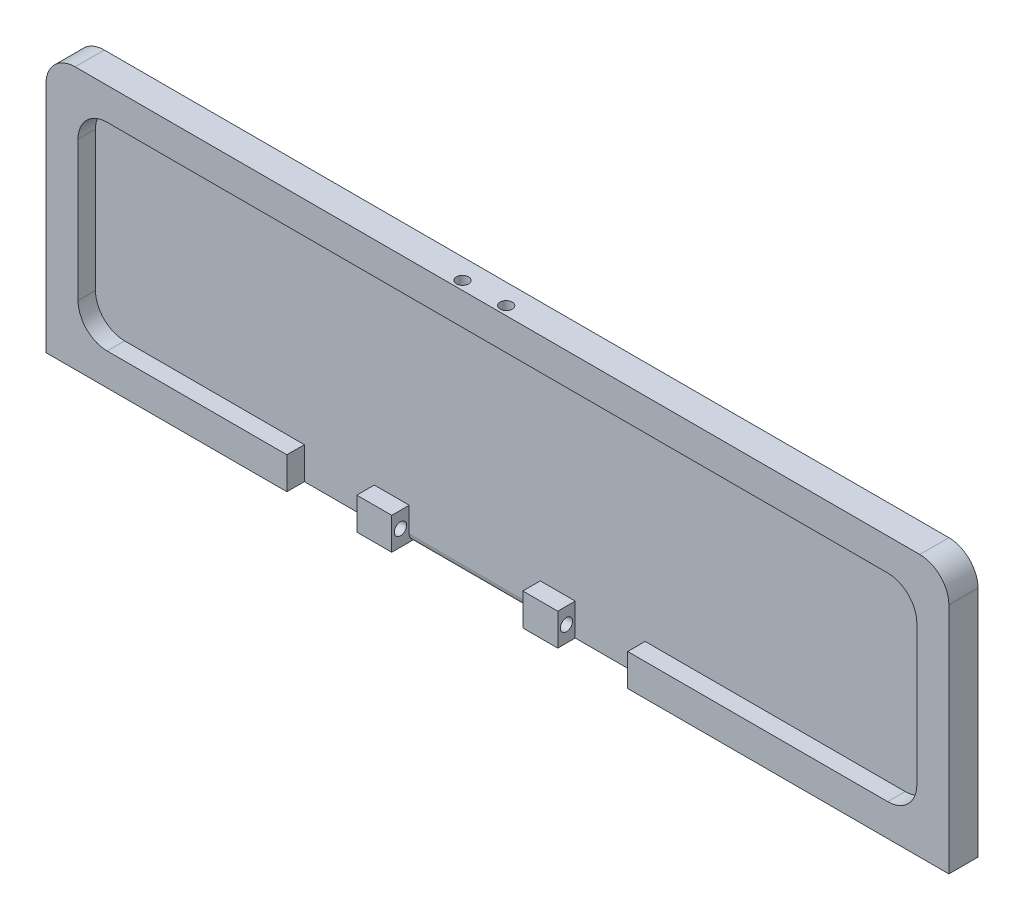
ISO-10303-21;
HEADER;
FILE_DESCRIPTION(('STEP AP214'),'2;1');
FILE_NAME('part.step','',(''),(''),'','','');
FILE_SCHEMA(('AUTOMOTIVE_DESIGN { 1 0 10303 214 1 1 1 1 }'));
ENDSEC;
DATA;
#1=APPLICATION_CONTEXT('core data for automotive mechanical design processes');
#2=APPLICATION_PROTOCOL_DEFINITION('international standard','automotive_design',2000,#1);
#3=PRODUCT_CONTEXT('',#1,'mechanical');
#4=PRODUCT('Part','Part','',(#3));
#5=PRODUCT_RELATED_PRODUCT_CATEGORY('part','',(#4));
#6=PRODUCT_DEFINITION_FORMATION('','',#4);
#7=PRODUCT_DEFINITION_CONTEXT('part definition',#1,'design');
#8=PRODUCT_DEFINITION('design','',#6,#7);
#9=PRODUCT_DEFINITION_SHAPE('','',#8);
#10=(LENGTH_UNIT() NAMED_UNIT(*) SI_UNIT(.MILLI.,.METRE.));
#11=(NAMED_UNIT(*) PLANE_ANGLE_UNIT() SI_UNIT($,.RADIAN.));
#12=(NAMED_UNIT(*) SI_UNIT($,.STERADIAN.) SOLID_ANGLE_UNIT());
#13=UNCERTAINTY_MEASURE_WITH_UNIT(LENGTH_MEASURE(1.E-05),#10,'distance_accuracy_value','');
#14=(GEOMETRIC_REPRESENTATION_CONTEXT(3) GLOBAL_UNCERTAINTY_ASSIGNED_CONTEXT((#13)) GLOBAL_UNIT_ASSIGNED_CONTEXT((#10,
#11,#12)) REPRESENTATION_CONTEXT('',''));
#15=CARTESIAN_POINT('',(0.,0.,0.));
#16=DIRECTION('',(0.,0.,1.));
#17=DIRECTION('',(1.,0.,0.));
#18=AXIS2_PLACEMENT_3D('',#15,#16,#17);
#19=CARTESIAN_POINT('',(0.,0.,5.));
#20=DIRECTION('',(0.,0.,1.));
#21=DIRECTION('',(1.,0.,0.));
#22=AXIS2_PLACEMENT_3D('',#19,#20,#21);
#23=PLANE('',#22);
#24=DIRECTION('',(0.,-1.,0.));
#25=VECTOR('',#24,1.);
#26=CARTESIAN_POINT('',(-36.1457275828644,-17.,5.));
#27=LINE('',#26,#25);
#28=CARTESIAN_POINT('',(-36.1457275828644,-17.,5.));
#29=VERTEX_POINT('',#28);
#30=CARTESIAN_POINT('',(-36.1457275828644,-22.5,5.));
#31=VERTEX_POINT('',#30);
#32=EDGE_CURVE('E232',#29,#31,#27,.T.);
#33=ORIENTED_EDGE('',*,*,#32,.F.);
#34=DIRECTION('',(1.,0.,0.));
#35=VECTOR('',#34,1.);
#36=CARTESIAN_POINT('',(72.,-17.,5.));
#37=LINE('',#36,#35);
#38=CARTESIAN_POINT('',(-67.,-17.,5.));
#39=VERTEX_POINT('',#38);
#40=EDGE_CURVE('E288',#39,#29,#37,.T.);
#41=ORIENTED_EDGE('',*,*,#40,.F.);
#42=CARTESIAN_POINT('',(-67.,-12.,5.));
#43=DIRECTION('',(0.,0.,1.));
#44=DIRECTION('',(1.,0.,0.));
#45=AXIS2_PLACEMENT_3D('',#42,#43,#44);
#46=CIRCLE('',#45,5.);
#47=CARTESIAN_POINT('',(-72.,-12.,5.));
#48=VERTEX_POINT('',#47);
#49=EDGE_CURVE('E463',#39,#48,#46,.F.);
#50=ORIENTED_EDGE('',*,*,#49,.T.);
#51=DIRECTION('',(0.,-1.,0.));
#52=VECTOR('',#51,1.);
#53=CARTESIAN_POINT('',(-72.,-17.,5.));
#54=LINE('',#53,#52);
#55=CARTESIAN_POINT('',(-72.,12.,5.));
#56=VERTEX_POINT('',#55);
#57=EDGE_CURVE('E293',#56,#48,#54,.T.);
#58=ORIENTED_EDGE('',*,*,#57,.F.);
#59=CARTESIAN_POINT('',(-67.,12.,5.));
#60=DIRECTION('',(0.,0.,1.));
#61=DIRECTION('',(1.,0.,0.));
#62=AXIS2_PLACEMENT_3D('',#59,#60,#61);
#63=CIRCLE('',#62,5.);
#64=CARTESIAN_POINT('',(-67.,17.,5.));
#65=VERTEX_POINT('',#64);
#66=EDGE_CURVE('E460',#56,#65,#63,.F.);
#67=ORIENTED_EDGE('',*,*,#66,.T.);
#68=DIRECTION('',(-1.,0.,0.));
#69=VECTOR('',#68,1.);
#70=CARTESIAN_POINT('',(72.,17.,5.));
#71=LINE('',#70,#69);
#72=CARTESIAN_POINT('',(67.,17.,5.));
#73=VERTEX_POINT('',#72);
#74=EDGE_CURVE('E280',#73,#65,#71,.T.);
#75=ORIENTED_EDGE('',*,*,#74,.F.);
#76=CARTESIAN_POINT('',(67.,12.,5.));
#77=DIRECTION('',(0.,0.,1.));
#78=DIRECTION('',(1.,0.,0.));
#79=AXIS2_PLACEMENT_3D('',#76,#77,#78);
#80=CIRCLE('',#79,5.);
#81=CARTESIAN_POINT('',(72.,12.,5.));
#82=VERTEX_POINT('',#81);
#83=EDGE_CURVE('E469',#73,#82,#80,.F.);
#84=ORIENTED_EDGE('',*,*,#83,.T.);
#85=DIRECTION('',(0.,1.,0.));
#86=VECTOR('',#85,1.);
#87=CARTESIAN_POINT('',(72.,-17.,5.));
#88=LINE('',#87,#86);
#89=CARTESIAN_POINT('',(72.,-12.,5.));
#90=VERTEX_POINT('',#89);
#91=EDGE_CURVE('E285',#90,#82,#88,.T.);
#92=ORIENTED_EDGE('',*,*,#91,.F.);
#93=CARTESIAN_POINT('',(67.,-12.,5.));
#94=DIRECTION('',(0.,0.,1.));
#95=DIRECTION('',(1.,0.,0.));
#96=AXIS2_PLACEMENT_3D('',#93,#94,#95);
#97=CIRCLE('',#96,5.);
#98=CARTESIAN_POINT('',(67.,-17.,5.));
#99=VERTEX_POINT('',#98);
#100=EDGE_CURVE('E466',#90,#99,#97,.F.);
#101=ORIENTED_EDGE('',*,*,#100,.T.);
#102=CARTESIAN_POINT('',(22.3542724171356,-17.,5.));
#103=VERTEX_POINT('',#102);
#104=EDGE_CURVE('E297',#103,#99,#37,.T.);
#105=ORIENTED_EDGE('',*,*,#104,.F.);
#106=DIRECTION('',(0.,1.,0.));
#107=VECTOR('',#106,1.);
#108=CARTESIAN_POINT('',(22.3542724171356,-17.,5.));
#109=LINE('',#108,#107);
#110=CARTESIAN_POINT('',(22.3542724171356,-22.5,5.));
#111=VERTEX_POINT('',#110);
#112=EDGE_CURVE('E362',#111,#103,#109,.T.);
#113=ORIENTED_EDGE('',*,*,#112,.F.);
#114=DIRECTION('',(1.,0.,0.));
#115=VECTOR('',#114,1.);
#116=CARTESIAN_POINT('',(77.5,-22.5,5.));
#117=LINE('',#116,#115);
#118=CARTESIAN_POINT('',(77.5,-22.5,5.));
#119=VERTEX_POINT('',#118);
#120=EDGE_CURVE('E251',#111,#119,#117,.T.);
#121=ORIENTED_EDGE('',*,*,#120,.T.);
#122=DIRECTION('',(0.,1.,0.));
#123=VECTOR('',#122,1.);
#124=CARTESIAN_POINT('',(77.5,-22.5,5.));
#125=LINE('',#124,#123);
#126=CARTESIAN_POINT('',(77.5,17.5,5.));
#127=VERTEX_POINT('',#126);
#128=EDGE_CURVE('E256',#119,#127,#125,.T.);
#129=ORIENTED_EDGE('',*,*,#128,.T.);
#130=CARTESIAN_POINT('',(72.5,17.5,5.));
#131=DIRECTION('',(0.,0.,1.));
#132=DIRECTION('',(1.,0.,0.));
#133=AXIS2_PLACEMENT_3D('',#130,#131,#132);
#134=CIRCLE('',#133,5.);
#135=CARTESIAN_POINT('',(72.5,22.5,5.));
#136=VERTEX_POINT('',#135);
#137=EDGE_CURVE('E557',#127,#136,#134,.T.);
#138=ORIENTED_EDGE('',*,*,#137,.T.);
#139=DIRECTION('',(-1.,0.,0.));
#140=VECTOR('',#139,1.);
#141=CARTESIAN_POINT('',(77.5,22.5,5.));
#142=LINE('',#141,#140);
#143=CARTESIAN_POINT('',(-72.5,22.5,5.));
#144=VERTEX_POINT('',#143);
#145=EDGE_CURVE('E587',#136,#144,#142,.T.);
#146=ORIENTED_EDGE('',*,*,#145,.T.);
#147=CARTESIAN_POINT('',(-72.5,17.5,5.));
#148=DIRECTION('',(0.,0.,1.));
#149=DIRECTION('',(1.,0.,0.));
#150=AXIS2_PLACEMENT_3D('',#147,#148,#149);
#151=CIRCLE('',#150,5.);
#152=CARTESIAN_POINT('',(-77.5,17.5,5.));
#153=VERTEX_POINT('',#152);
#154=EDGE_CURVE('E562',#144,#153,#151,.T.);
#155=ORIENTED_EDGE('',*,*,#154,.T.);
#156=DIRECTION('',(0.,-1.,0.));
#157=VECTOR('',#156,1.);
#158=CARTESIAN_POINT('',(-77.5,-22.5,5.));
#159=LINE('',#158,#157);
#160=CARTESIAN_POINT('',(-77.5,-22.5,5.));
#161=VERTEX_POINT('',#160);
#162=EDGE_CURVE('E262',#153,#161,#159,.T.);
#163=ORIENTED_EDGE('',*,*,#162,.T.);
#164=EDGE_CURVE('E248',#161,#31,#117,.T.);
#165=ORIENTED_EDGE('',*,*,#164,.T.);
#166=EDGE_LOOP('',(#33,#41,#50,#58,#67,#75,#84,#92,#101,#105,#113,#121,#129,#138,#146,#155,#163,#165));
#167=FACE_BOUND('',#166,.T.);
#168=ADVANCED_FACE('F43',(#167),#23,.T.);
#169=CARTESIAN_POINT('',(72.,-17.,2.));
#170=DIRECTION('',(0.,-1.,0.));
#171=DIRECTION('',(0.,0.,-1.));
#172=AXIS2_PLACEMENT_3D('',#169,#170,#171);
#173=PLANE('',#172);
#174=ORIENTED_EDGE('',*,*,#40,.T.);
#175=DIRECTION('',(0.,0.,1.));
#176=VECTOR('',#175,1.);
#177=CARTESIAN_POINT('',(-36.1457275828644,-17.,-11.2003787824441));
#178=LINE('',#177,#176);
#179=CARTESIAN_POINT('',(-36.1457275828644,-17.,2.));
#180=VERTEX_POINT('',#179);
#181=EDGE_CURVE('E405',#180,#29,#178,.T.);
#182=ORIENTED_EDGE('',*,*,#181,.F.);
#183=DIRECTION('',(1.,0.,0.));
#184=VECTOR('',#183,1.);
#185=CARTESIAN_POINT('',(72.,-17.,2.));
#186=LINE('',#185,#184);
#187=CARTESIAN_POINT('',(-67.,-17.,2.));
#188=VERTEX_POINT('',#187);
#189=EDGE_CURVE('E308',#188,#180,#186,.T.);
#190=ORIENTED_EDGE('',*,*,#189,.F.);
#191=DIRECTION('',(0.,0.,1.));
#192=VECTOR('',#191,1.);
#193=CARTESIAN_POINT('',(-67.,-17.,5.));
#194=LINE('',#193,#192);
#195=EDGE_CURVE('E450',#188,#39,#194,.T.);
#196=ORIENTED_EDGE('',*,*,#195,.T.);
#197=EDGE_LOOP('',(#174,#182,#190,#196));
#198=FACE_BOUND('',#197,.T.);
#199=ADVANCED_FACE('F426',(#198),#173,.F.);
#200=CARTESIAN_POINT('',(4.35427241713557,-17.,5.));
#201=VERTEX_POINT('',#200);
#202=CARTESIAN_POINT('',(10.3542724171356,-17.,5.));
#203=VERTEX_POINT('',#202);
#204=EDGE_CURVE('E292',#201,#203,#37,.T.);
#205=ORIENTED_EDGE('',*,*,#204,.T.);
#206=DIRECTION('',(0.,0.,1.));
#207=VECTOR('',#206,1.);
#208=CARTESIAN_POINT('',(10.3542724171356,-17.,2.));
#209=LINE('',#208,#207);
#210=CARTESIAN_POINT('',(10.3542724171356,-17.,2.));
#211=VERTEX_POINT('',#210);
#212=EDGE_CURVE('E352',#211,#203,#209,.T.);
#213=ORIENTED_EDGE('',*,*,#212,.F.);
#214=CARTESIAN_POINT('',(4.35427241713557,-17.,2.));
#215=VERTEX_POINT('',#214);
#216=EDGE_CURVE('E313',#215,#211,#186,.T.);
#217=ORIENTED_EDGE('',*,*,#216,.F.);
#218=DIRECTION('',(0.,0.,1.));
#219=VECTOR('',#218,1.);
#220=CARTESIAN_POINT('',(4.35427241713557,-17.,2.));
#221=LINE('',#220,#219);
#222=EDGE_CURVE('E298',#215,#201,#221,.T.);
#223=ORIENTED_EDGE('',*,*,#222,.T.);
#224=EDGE_LOOP('',(#205,#213,#217,#223));
#225=FACE_BOUND('',#224,.T.);
#226=ADVANCED_FACE('F499',(#225),#173,.F.);
#227=DIRECTION('',(0.,-1.,0.));
#228=VECTOR('',#227,1.);
#229=CARTESIAN_POINT('',(10.3542724171356,-22.5,5.));
#230=LINE('',#229,#228);
#231=CARTESIAN_POINT('',(10.3542724171356,-22.5,5.));
#232=VERTEX_POINT('',#231);
#233=EDGE_CURVE('E358',#203,#232,#230,.T.);
#234=ORIENTED_EDGE('',*,*,#233,.F.);
#235=ORIENTED_EDGE('',*,*,#204,.F.);
#236=DIRECTION('',(0.,1.,0.));
#237=VECTOR('',#236,1.);
#238=CARTESIAN_POINT('',(4.35427241713557,-17.,5.));
#239=LINE('',#238,#237);
#240=CARTESIAN_POINT('',(4.35427241713557,-22.5,5.));
#241=VERTEX_POINT('',#240);
#242=EDGE_CURVE('E331',#241,#201,#239,.T.);
#243=ORIENTED_EDGE('',*,*,#242,.F.);
#244=EDGE_CURVE('E249',#241,#232,#117,.T.);
#245=ORIENTED_EDGE('',*,*,#244,.T.);
#246=EDGE_LOOP('',(#234,#235,#243,#245));
#247=FACE_BOUND('',#246,.T.);
#248=ADVANCED_FACE('F494',(#247),#23,.T.);
#249=CARTESIAN_POINT('',(22.3542724171356,-17.,2.));
#250=VERTEX_POINT('',#249);
#251=CARTESIAN_POINT('',(67.,-17.,2.));
#252=VERTEX_POINT('',#251);
#253=EDGE_CURVE('E317',#250,#252,#186,.T.);
#254=ORIENTED_EDGE('',*,*,#253,.F.);
#255=DIRECTION('',(0.,0.,1.));
#256=VECTOR('',#255,1.);
#257=CARTESIAN_POINT('',(22.3542724171356,-17.,2.));
#258=LINE('',#257,#256);
#259=EDGE_CURVE('E347',#250,#103,#258,.T.);
#260=ORIENTED_EDGE('',*,*,#259,.T.);
#261=ORIENTED_EDGE('',*,*,#104,.T.);
#262=DIRECTION('',(0.,0.,1.));
#263=VECTOR('',#262,1.);
#264=CARTESIAN_POINT('',(67.,-17.,2.));
#265=LINE('',#264,#263);
#266=EDGE_CURVE('E441',#99,#252,#265,.F.);
#267=ORIENTED_EDGE('',*,*,#266,.T.);
#268=EDGE_LOOP('',(#254,#260,#261,#267));
#269=FACE_BOUND('',#268,.T.);
#270=ADVANCED_FACE('F512',(#269),#173,.F.);
#271=CARTESIAN_POINT('',(-77.5,-22.5,5.));
#272=DIRECTION('',(1.,0.,0.));
#273=DIRECTION('',(0.,0.,-1.));
#274=AXIS2_PLACEMENT_3D('',#271,#272,#273);
#275=PLANE('',#274);
#276=ORIENTED_EDGE('',*,*,#162,.F.);
#277=DIRECTION('',(0.,0.,-1.));
#278=VECTOR('',#277,1.);
#279=CARTESIAN_POINT('',(-77.5,17.5,5.));
#280=LINE('',#279,#278);
#281=CARTESIAN_POINT('',(-77.5,17.5,0.));
#282=VERTEX_POINT('',#281);
#283=EDGE_CURVE('E554',#153,#282,#280,.T.);
#284=ORIENTED_EDGE('',*,*,#283,.T.);
#285=DIRECTION('',(0.,-1.,0.));
#286=VECTOR('',#285,1.);
#287=CARTESIAN_POINT('',(-77.5,-22.5,0.));
#288=LINE('',#287,#286);
#289=CARTESIAN_POINT('',(-77.5,-22.5,0.));
#290=VERTEX_POINT('',#289);
#291=EDGE_CURVE('E303',#282,#290,#288,.T.);
#292=ORIENTED_EDGE('',*,*,#291,.T.);
#293=DIRECTION('',(0.,0.,-1.));
#294=VECTOR('',#293,1.);
#295=CARTESIAN_POINT('',(-77.5,-22.5,5.));
#296=LINE('',#295,#294);
#297=EDGE_CURVE('E581',#161,#290,#296,.T.);
#298=ORIENTED_EDGE('',*,*,#297,.F.);
#299=EDGE_LOOP('',(#276,#284,#292,#298));
#300=FACE_BOUND('',#299,.T.);
#301=ADVANCED_FACE('F620',(#300),#275,.F.);
#302=CARTESIAN_POINT('',(77.5,-22.5,5.));
#303=DIRECTION('',(0.,1.,0.));
#304=DIRECTION('',(-1.,0.,0.));
#305=AXIS2_PLACEMENT_3D('',#302,#303,#304);
#306=PLANE('',#305);
#307=DIRECTION('',(-1.,0.,0.));
#308=VECTOR('',#307,1.);
#309=CARTESIAN_POINT('',(-36.1457275828644,-22.5,2.));
#310=LINE('',#309,#308);
#311=CARTESIAN_POINT('',(-24.1457275828644,-22.5,2.));
#312=VERTEX_POINT('',#311);
#313=CARTESIAN_POINT('',(-36.1457275828644,-22.5,2.));
#314=VERTEX_POINT('',#313);
#315=EDGE_CURVE('E401',#312,#314,#310,.T.);
#316=ORIENTED_EDGE('',*,*,#315,.T.);
#317=DIRECTION('',(0.,0.,1.));
#318=VECTOR('',#317,1.);
#319=CARTESIAN_POINT('',(-36.1457275828644,-22.5,-11.2003787824441));
#320=LINE('',#319,#318);
#321=EDGE_CURVE('E407',#314,#31,#320,.T.);
#322=ORIENTED_EDGE('',*,*,#321,.T.);
#323=ORIENTED_EDGE('',*,*,#164,.F.);
#324=ORIENTED_EDGE('',*,*,#297,.T.);
#325=DIRECTION('',(1.,0.,0.));
#326=VECTOR('',#325,1.);
#327=CARTESIAN_POINT('',(77.5,-22.5,0.));
#328=LINE('',#327,#326);
#329=CARTESIAN_POINT('',(77.5,-22.5,0.));
#330=VERTEX_POINT('',#329);
#331=EDGE_CURVE('E592',#290,#330,#328,.T.);
#332=ORIENTED_EDGE('',*,*,#331,.T.);
#333=DIRECTION('',(0.,0.,-1.));
#334=VECTOR('',#333,1.);
#335=CARTESIAN_POINT('',(77.5,-22.5,5.));
#336=LINE('',#335,#334);
#337=EDGE_CURVE('E585',#119,#330,#336,.T.);
#338=ORIENTED_EDGE('',*,*,#337,.F.);
#339=ORIENTED_EDGE('',*,*,#120,.F.);
#340=DIRECTION('',(0.,0.,1.));
#341=VECTOR('',#340,1.);
#342=CARTESIAN_POINT('',(22.3542724171356,-22.5,2.));
#343=LINE('',#342,#341);
#344=CARTESIAN_POINT('',(22.3542724171356,-22.5,2.));
#345=VERTEX_POINT('',#344);
#346=EDGE_CURVE('E344',#345,#111,#343,.T.);
#347=ORIENTED_EDGE('',*,*,#346,.F.);
#348=DIRECTION('',(1.,0.,0.));
#349=VECTOR('',#348,1.);
#350=CARTESIAN_POINT('',(22.3542724171356,-22.5,2.));
#351=LINE('',#350,#349);
#352=CARTESIAN_POINT('',(10.3542724171356,-22.5,2.));
#353=VERTEX_POINT('',#352);
#354=EDGE_CURVE('E361',#353,#345,#351,.T.);
#355=ORIENTED_EDGE('',*,*,#354,.F.);
#356=DIRECTION('',(0.,0.,1.));
#357=VECTOR('',#356,1.);
#358=CARTESIAN_POINT('',(10.3542724171356,-22.5,2.));
#359=LINE('',#358,#357);
#360=EDGE_CURVE('E338',#353,#232,#359,.T.);
#361=ORIENTED_EDGE('',*,*,#360,.T.);
#362=ORIENTED_EDGE('',*,*,#244,.F.);
#363=DIRECTION('',(0.,0.,1.));
#364=VECTOR('',#363,1.);
#365=CARTESIAN_POINT('',(4.35427241713557,-22.5,2.));
#366=LINE('',#365,#364);
#367=CARTESIAN_POINT('',(4.35427241713557,-22.5,0.8));
#368=VERTEX_POINT('',#367);
#369=EDGE_CURVE('E325',#368,#241,#366,.T.);
#370=ORIENTED_EDGE('',*,*,#369,.F.);
#371=DIRECTION('',(1.,0.,0.));
#372=VECTOR('',#371,1.);
#373=CARTESIAN_POINT('',(-18.1457275828644,-22.5,0.8));
#374=LINE('',#373,#372);
#375=CARTESIAN_POINT('',(-18.1457275828644,-22.5,0.8));
#376=VERTEX_POINT('',#375);
#377=EDGE_CURVE('E476',#368,#376,#374,.F.);
#378=ORIENTED_EDGE('',*,*,#377,.T.);
#379=DIRECTION('',(0.,0.,1.));
#380=VECTOR('',#379,1.);
#381=CARTESIAN_POINT('',(-18.1457275828644,-22.5,2.));
#382=LINE('',#381,#380);
#383=CARTESIAN_POINT('',(-18.1457275828644,-22.5,5.));
#384=VERTEX_POINT('',#383);
#385=EDGE_CURVE('E246',#376,#384,#382,.T.);
#386=ORIENTED_EDGE('',*,*,#385,.T.);
#387=CARTESIAN_POINT('',(-24.1457275828644,-22.5,5.));
#388=VERTEX_POINT('',#387);
#389=EDGE_CURVE('E238',#388,#384,#117,.T.);
#390=ORIENTED_EDGE('',*,*,#389,.F.);
#391=DIRECTION('',(0.,0.,1.));
#392=VECTOR('',#391,1.);
#393=CARTESIAN_POINT('',(-24.1457275828644,-22.5,-11.2003787824441));
#394=LINE('',#393,#392);
#395=EDGE_CURVE('E221',#312,#388,#394,.T.);
#396=ORIENTED_EDGE('',*,*,#395,.F.);
#397=EDGE_LOOP('',(#316,#322,#323,#324,#332,#338,#339,#347,#355,#361,#362,#370,#378,#386,#390,#396));
#398=FACE_BOUND('',#397,.T.);
#399=ADVANCED_FACE('F244',(#398),#306,.F.);
#400=CARTESIAN_POINT('',(77.5,-22.5,5.));
#401=DIRECTION('',(-1.,0.,0.));
#402=DIRECTION('',(0.,0.,1.));
#403=AXIS2_PLACEMENT_3D('',#400,#401,#402);
#404=PLANE('',#403);
#405=DIRECTION('',(0.,1.,0.));
#406=VECTOR('',#405,1.);
#407=CARTESIAN_POINT('',(77.5,-22.5,0.));
#408=LINE('',#407,#406);
#409=CARTESIAN_POINT('',(77.5,17.5,0.));
#410=VERTEX_POINT('',#409);
#411=EDGE_CURVE('E277',#330,#410,#408,.T.);
#412=ORIENTED_EDGE('',*,*,#411,.T.);
#413=DIRECTION('',(0.,0.,-1.));
#414=VECTOR('',#413,1.);
#415=CARTESIAN_POINT('',(77.5,17.5,5.));
#416=LINE('',#415,#414);
#417=EDGE_CURVE('E565',#410,#127,#416,.F.);
#418=ORIENTED_EDGE('',*,*,#417,.T.);
#419=ORIENTED_EDGE('',*,*,#128,.F.);
#420=ORIENTED_EDGE('',*,*,#337,.T.);
#421=EDGE_LOOP('',(#412,#418,#419,#420));
#422=FACE_BOUND('',#421,.T.);
#423=ADVANCED_FACE('F622',(#422),#404,.F.);
#424=CARTESIAN_POINT('',(77.5,22.5,5.));
#425=DIRECTION('',(0.,-1.,0.));
#426=DIRECTION('',(1.,0.,0.));
#427=AXIS2_PLACEMENT_3D('',#424,#425,#426);
#428=PLANE('',#427);
#429=CARTESIAN_POINT('',(0.,22.5,3.5));
#430=DIRECTION('',(0.,1.,0.));
#431=DIRECTION('',(0.,0.,1.));
#432=AXIS2_PLACEMENT_3D('',#429,#430,#431);
#433=CIRCLE('',#432,1.04999999999999);
#434=CARTESIAN_POINT('',(0.,22.5,4.54999999999999));
#435=VERTEX_POINT('',#434);
#436=EDGE_CURVE('E396',#435,#435,#433,.T.);
#437=ORIENTED_EDGE('',*,*,#436,.F.);
#438=EDGE_LOOP('',(#437));
#439=FACE_BOUND('',#438,.T.);
#440=CARTESIAN_POINT('',(-7.5,22.5,3.5));
#441=DIRECTION('',(0.,1.,0.));
#442=DIRECTION('',(0.,0.,1.));
#443=AXIS2_PLACEMENT_3D('',#440,#441,#442);
#444=CIRCLE('',#443,1.04999999999999);
#445=CARTESIAN_POINT('',(-7.5,22.5,4.54999999999999));
#446=VERTEX_POINT('',#445);
#447=EDGE_CURVE('E388',#446,#446,#444,.T.);
#448=ORIENTED_EDGE('',*,*,#447,.F.);
#449=EDGE_LOOP('',(#448));
#450=FACE_BOUND('',#449,.T.);
#451=ORIENTED_EDGE('',*,*,#145,.F.);
#452=DIRECTION('',(0.,0.,-1.));
#453=VECTOR('',#452,1.);
#454=CARTESIAN_POINT('',(72.5,22.5,5.));
#455=LINE('',#454,#453);
#456=CARTESIAN_POINT('',(72.5,22.5,0.));
#457=VERTEX_POINT('',#456);
#458=EDGE_CURVE('E574',#136,#457,#455,.T.);
#459=ORIENTED_EDGE('',*,*,#458,.T.);
#460=DIRECTION('',(-1.,0.,0.));
#461=VECTOR('',#460,1.);
#462=CARTESIAN_POINT('',(77.5,22.5,0.));
#463=LINE('',#462,#461);
#464=CARTESIAN_POINT('',(-72.5,22.5,0.));
#465=VERTEX_POINT('',#464);
#466=EDGE_CURVE('E271',#457,#465,#463,.T.);
#467=ORIENTED_EDGE('',*,*,#466,.T.);
#468=DIRECTION('',(0.,0.,-1.));
#469=VECTOR('',#468,1.);
#470=CARTESIAN_POINT('',(-72.5,22.5,5.));
#471=LINE('',#470,#469);
#472=EDGE_CURVE('E578',#465,#144,#471,.F.);
#473=ORIENTED_EDGE('',*,*,#472,.T.);
#474=EDGE_LOOP('',(#451,#459,#467,#473));
#475=FACE_BOUND('',#474,.T.);
#476=ADVANCED_FACE('F608',(#439,#450,#475),#428,.F.);
#477=DIRECTION('',(0.,1.,0.));
#478=VECTOR('',#477,1.);
#479=CARTESIAN_POINT('',(-24.1457275828644,-22.5,5.));
#480=LINE('',#479,#478);
#481=CARTESIAN_POINT('',(-24.1457275828644,-17.,5.));
#482=VERTEX_POINT('',#481);
#483=EDGE_CURVE('E225',#388,#482,#480,.T.);
#484=ORIENTED_EDGE('',*,*,#483,.F.);
#485=ORIENTED_EDGE('',*,*,#389,.T.);
#486=DIRECTION('',(0.,-1.,0.));
#487=VECTOR('',#486,1.);
#488=CARTESIAN_POINT('',(-18.1457275828644,-22.5,5.));
#489=LINE('',#488,#487);
#490=CARTESIAN_POINT('',(-18.1457275828644,-17.,5.));
#491=VERTEX_POINT('',#490);
#492=EDGE_CURVE('E335',#491,#384,#489,.T.);
#493=ORIENTED_EDGE('',*,*,#492,.F.);
#494=EDGE_CURVE('E240',#482,#491,#37,.T.);
#495=ORIENTED_EDGE('',*,*,#494,.F.);
#496=EDGE_LOOP('',(#484,#485,#493,#495));
#497=FACE_BOUND('',#496,.T.);
#498=ADVANCED_FACE('F236',(#497),#23,.T.);
#499=CARTESIAN_POINT('',(0.,0.,0.));
#500=DIRECTION('',(0.,0.,1.));
#501=DIRECTION('',(1.,0.,0.));
#502=AXIS2_PLACEMENT_3D('',#499,#500,#501);
#503=PLANE('',#502);
#504=ORIENTED_EDGE('',*,*,#466,.F.);
#505=CARTESIAN_POINT('',(72.5,17.5,0.));
#506=DIRECTION('',(0.,0.,1.));
#507=DIRECTION('',(1.,0.,0.));
#508=AXIS2_PLACEMENT_3D('',#505,#506,#507);
#509=CIRCLE('',#508,5.);
#510=EDGE_CURVE('E568',#457,#410,#509,.F.);
#511=ORIENTED_EDGE('',*,*,#510,.T.);
#512=ORIENTED_EDGE('',*,*,#411,.F.);
#513=ORIENTED_EDGE('',*,*,#331,.F.);
#514=ORIENTED_EDGE('',*,*,#291,.F.);
#515=CARTESIAN_POINT('',(-72.5,17.5,0.));
#516=DIRECTION('',(0.,0.,1.));
#517=DIRECTION('',(1.,0.,0.));
#518=AXIS2_PLACEMENT_3D('',#515,#516,#517);
#519=CIRCLE('',#518,5.);
#520=EDGE_CURVE('E571',#282,#465,#519,.F.);
#521=ORIENTED_EDGE('',*,*,#520,.T.);
#522=EDGE_LOOP('',(#504,#511,#512,#513,#514,#521));
#523=FACE_BOUND('',#522,.T.);
#524=ADVANCED_FACE('F611',(#523),#503,.F.);
#525=CARTESIAN_POINT('',(-72.,-17.,2.));
#526=DIRECTION('',(-1.,0.,0.));
#527=DIRECTION('',(0.,0.,1.));
#528=AXIS2_PLACEMENT_3D('',#525,#526,#527);
#529=PLANE('',#528);
#530=DIRECTION('',(0.,-1.,0.));
#531=VECTOR('',#530,1.);
#532=CARTESIAN_POINT('',(-72.,-17.,2.));
#533=LINE('',#532,#531);
#534=CARTESIAN_POINT('',(-72.,12.,2.));
#535=VERTEX_POINT('',#534);
#536=CARTESIAN_POINT('',(-72.,-12.,2.));
#537=VERTEX_POINT('',#536);
#538=EDGE_CURVE('E284',#535,#537,#533,.T.);
#539=ORIENTED_EDGE('',*,*,#538,.F.);
#540=DIRECTION('',(0.,0.,1.));
#541=VECTOR('',#540,1.);
#542=CARTESIAN_POINT('',(-72.,12.,5.));
#543=LINE('',#542,#541);
#544=EDGE_CURVE('E534',#535,#56,#543,.T.);
#545=ORIENTED_EDGE('',*,*,#544,.T.);
#546=ORIENTED_EDGE('',*,*,#57,.T.);
#547=DIRECTION('',(0.,0.,1.));
#548=VECTOR('',#547,1.);
#549=CARTESIAN_POINT('',(-72.,-12.,2.));
#550=LINE('',#549,#548);
#551=EDGE_CURVE('E541',#48,#537,#550,.F.);
#552=ORIENTED_EDGE('',*,*,#551,.T.);
#553=EDGE_LOOP('',(#539,#545,#546,#552));
#554=FACE_BOUND('',#553,.T.);
#555=ADVANCED_FACE('F551',(#554),#529,.F.);
#556=CARTESIAN_POINT('',(72.,17.,2.));
#557=DIRECTION('',(0.,1.,0.));
#558=DIRECTION('',(0.,0.,1.));
#559=AXIS2_PLACEMENT_3D('',#556,#557,#558);
#560=PLANE('',#559);
#561=CARTESIAN_POINT('',(0.,17.,3.5));
#562=DIRECTION('',(0.,1.,0.));
#563=DIRECTION('',(0.,0.,1.));
#564=AXIS2_PLACEMENT_3D('',#561,#562,#563);
#565=CIRCLE('',#564,1.04999999999999);
#566=CARTESIAN_POINT('',(0.,17.,4.54999999999999));
#567=VERTEX_POINT('',#566);
#568=EDGE_CURVE('E392',#567,#567,#565,.T.);
#569=ORIENTED_EDGE('',*,*,#568,.T.);
#570=EDGE_LOOP('',(#569));
#571=FACE_BOUND('',#570,.T.);
#572=CARTESIAN_POINT('',(-7.5,17.,3.5));
#573=DIRECTION('',(0.,1.,0.));
#574=DIRECTION('',(0.,0.,1.));
#575=AXIS2_PLACEMENT_3D('',#572,#573,#574);
#576=CIRCLE('',#575,1.04999999999999);
#577=CARTESIAN_POINT('',(-7.5,17.,4.54999999999999));
#578=VERTEX_POINT('',#577);
#579=EDGE_CURVE('E384',#578,#578,#576,.T.);
#580=ORIENTED_EDGE('',*,*,#579,.T.);
#581=EDGE_LOOP('',(#580));
#582=FACE_BOUND('',#581,.T.);
#583=ORIENTED_EDGE('',*,*,#74,.T.);
#584=DIRECTION('',(0.,0.,1.));
#585=VECTOR('',#584,1.);
#586=CARTESIAN_POINT('',(-67.,17.,2.));
#587=LINE('',#586,#585);
#588=CARTESIAN_POINT('',(-67.,17.,2.));
#589=VERTEX_POINT('',#588);
#590=EDGE_CURVE('E533',#65,#589,#587,.F.);
#591=ORIENTED_EDGE('',*,*,#590,.T.);
#592=DIRECTION('',(-1.,0.,0.));
#593=VECTOR('',#592,1.);
#594=CARTESIAN_POINT('',(72.,17.,2.));
#595=LINE('',#594,#593);
#596=CARTESIAN_POINT('',(67.,17.,2.));
#597=VERTEX_POINT('',#596);
#598=EDGE_CURVE('E299',#597,#589,#595,.T.);
#599=ORIENTED_EDGE('',*,*,#598,.F.);
#600=DIRECTION('',(0.,0.,1.));
#601=VECTOR('',#600,1.);
#602=CARTESIAN_POINT('',(67.,17.,5.));
#603=LINE('',#602,#601);
#604=EDGE_CURVE('E527',#597,#73,#603,.T.);
#605=ORIENTED_EDGE('',*,*,#604,.T.);
#606=EDGE_LOOP('',(#583,#591,#599,#605));
#607=FACE_BOUND('',#606,.T.);
#608=ADVANCED_FACE('F530',(#571,#582,#607),#560,.F.);
#609=CARTESIAN_POINT('',(72.,-17.,2.));
#610=DIRECTION('',(1.,0.,0.));
#611=DIRECTION('',(0.,0.,-1.));
#612=AXIS2_PLACEMENT_3D('',#609,#610,#611);
#613=PLANE('',#612);
#614=DIRECTION('',(0.,1.,0.));
#615=VECTOR('',#614,1.);
#616=CARTESIAN_POINT('',(72.,-17.,2.));
#617=LINE('',#616,#615);
#618=CARTESIAN_POINT('',(72.,-12.,2.));
#619=VERTEX_POINT('',#618);
#620=CARTESIAN_POINT('',(72.,12.,2.));
#621=VERTEX_POINT('',#620);
#622=EDGE_CURVE('E304',#619,#621,#617,.T.);
#623=ORIENTED_EDGE('',*,*,#622,.F.);
#624=DIRECTION('',(0.,0.,1.));
#625=VECTOR('',#624,1.);
#626=CARTESIAN_POINT('',(72.,-12.,5.));
#627=LINE('',#626,#625);
#628=EDGE_CURVE('E456',#619,#90,#627,.T.);
#629=ORIENTED_EDGE('',*,*,#628,.T.);
#630=ORIENTED_EDGE('',*,*,#91,.T.);
#631=DIRECTION('',(0.,0.,1.));
#632=VECTOR('',#631,1.);
#633=CARTESIAN_POINT('',(72.,12.,2.));
#634=LINE('',#633,#632);
#635=EDGE_CURVE('E453',#82,#621,#634,.F.);
#636=ORIENTED_EDGE('',*,*,#635,.T.);
#637=EDGE_LOOP('',(#623,#629,#630,#636));
#638=FACE_BOUND('',#637,.T.);
#639=ADVANCED_FACE('F519',(#638),#613,.F.);
#640=CARTESIAN_POINT('',(-24.1457275828644,-17.,2.));
#641=VERTEX_POINT('',#640);
#642=CARTESIAN_POINT('',(-18.1457275828644,-17.,2.));
#643=VERTEX_POINT('',#642);
#644=EDGE_CURVE('E312',#641,#643,#186,.T.);
#645=ORIENTED_EDGE('',*,*,#644,.F.);
#646=DIRECTION('',(0.,0.,1.));
#647=VECTOR('',#646,1.);
#648=CARTESIAN_POINT('',(-24.1457275828644,-17.,-11.2003787824441));
#649=LINE('',#648,#647);
#650=EDGE_CURVE('E231',#641,#482,#649,.T.);
#651=ORIENTED_EDGE('',*,*,#650,.T.);
#652=ORIENTED_EDGE('',*,*,#494,.T.);
#653=DIRECTION('',(0.,0.,1.));
#654=VECTOR('',#653,1.);
#655=CARTESIAN_POINT('',(-18.1457275828644,-17.,2.));
#656=LINE('',#655,#654);
#657=EDGE_CURVE('E318',#643,#491,#656,.T.);
#658=ORIENTED_EDGE('',*,*,#657,.F.);
#659=EDGE_LOOP('',(#645,#651,#652,#658));
#660=FACE_BOUND('',#659,.T.);
#661=ADVANCED_FACE('F638',(#660),#173,.F.);
#662=CARTESIAN_POINT('',(0.,0.,2.));
#663=DIRECTION('',(0.,0.,1.));
#664=DIRECTION('',(1.,0.,0.));
#665=AXIS2_PLACEMENT_3D('',#662,#663,#664);
#666=PLANE('',#665);
#667=DIRECTION('',(0.,-1.,0.));
#668=VECTOR('',#667,1.);
#669=CARTESIAN_POINT('',(-18.1457275828644,-22.5,2.));
#670=LINE('',#669,#668);
#671=CARTESIAN_POINT('',(-18.1457275828644,-21.3,2.));
#672=VERTEX_POINT('',#671);
#673=EDGE_CURVE('E334',#643,#672,#670,.T.);
#674=ORIENTED_EDGE('',*,*,#673,.T.);
#675=DIRECTION('',(1.,0.,0.));
#676=VECTOR('',#675,1.);
#677=CARTESIAN_POINT('',(4.35427241713557,-21.3,2.));
#678=LINE('',#677,#676);
#679=CARTESIAN_POINT('',(4.35427241713557,-21.3,2.));
#680=VERTEX_POINT('',#679);
#681=EDGE_CURVE('E472',#672,#680,#678,.T.);
#682=ORIENTED_EDGE('',*,*,#681,.T.);
#683=DIRECTION('',(0.,1.,0.));
#684=VECTOR('',#683,1.);
#685=CARTESIAN_POINT('',(4.35427241713557,-17.,2.));
#686=LINE('',#685,#684);
#687=EDGE_CURVE('E322',#680,#215,#686,.T.);
#688=ORIENTED_EDGE('',*,*,#687,.T.);
#689=ORIENTED_EDGE('',*,*,#216,.T.);
#690=DIRECTION('',(0.,-1.,0.));
#691=VECTOR('',#690,1.);
#692=CARTESIAN_POINT('',(10.3542724171356,-22.5,2.));
#693=LINE('',#692,#691);
#694=EDGE_CURVE('E348',#211,#353,#693,.T.);
#695=ORIENTED_EDGE('',*,*,#694,.T.);
#696=ORIENTED_EDGE('',*,*,#354,.T.);
#697=DIRECTION('',(0.,1.,0.));
#698=VECTOR('',#697,1.);
#699=CARTESIAN_POINT('',(22.3542724171356,-17.,2.));
#700=LINE('',#699,#698);
#701=EDGE_CURVE('E67',#345,#250,#700,.T.);
#702=ORIENTED_EDGE('',*,*,#701,.T.);
#703=ORIENTED_EDGE('',*,*,#253,.T.);
#704=CARTESIAN_POINT('',(67.,-12.,2.));
#705=DIRECTION('',(0.,0.,1.));
#706=DIRECTION('',(1.,0.,0.));
#707=AXIS2_PLACEMENT_3D('',#704,#705,#706);
#708=CIRCLE('',#707,5.);
#709=EDGE_CURVE('E438',#252,#619,#708,.T.);
#710=ORIENTED_EDGE('',*,*,#709,.T.);
#711=ORIENTED_EDGE('',*,*,#622,.T.);
#712=CARTESIAN_POINT('',(67.,12.,2.));
#713=DIRECTION('',(0.,0.,1.));
#714=DIRECTION('',(1.,0.,0.));
#715=AXIS2_PLACEMENT_3D('',#712,#713,#714);
#716=CIRCLE('',#715,5.);
#717=EDGE_CURVE('E443',#621,#597,#716,.T.);
#718=ORIENTED_EDGE('',*,*,#717,.T.);
#719=ORIENTED_EDGE('',*,*,#598,.T.);
#720=CARTESIAN_POINT('',(-67.,12.,2.));
#721=DIRECTION('',(0.,0.,1.));
#722=DIRECTION('',(1.,0.,0.));
#723=AXIS2_PLACEMENT_3D('',#720,#721,#722);
#724=CIRCLE('',#723,5.);
#725=EDGE_CURVE('E437',#589,#535,#724,.T.);
#726=ORIENTED_EDGE('',*,*,#725,.T.);
#727=ORIENTED_EDGE('',*,*,#538,.T.);
#728=CARTESIAN_POINT('',(-67.,-12.,2.));
#729=DIRECTION('',(0.,0.,1.));
#730=DIRECTION('',(1.,0.,0.));
#731=AXIS2_PLACEMENT_3D('',#728,#729,#730);
#732=CIRCLE('',#731,5.);
#733=EDGE_CURVE('E432',#537,#188,#732,.T.);
#734=ORIENTED_EDGE('',*,*,#733,.T.);
#735=ORIENTED_EDGE('',*,*,#189,.T.);
#736=DIRECTION('',(0.,1.,0.));
#737=VECTOR('',#736,1.);
#738=CARTESIAN_POINT('',(-36.1457275828644,-17.,2.));
#739=LINE('',#738,#737);
#740=EDGE_CURVE('E411',#314,#180,#739,.T.);
#741=ORIENTED_EDGE('',*,*,#740,.F.);
#742=ORIENTED_EDGE('',*,*,#315,.F.);
#743=DIRECTION('',(0.,-1.,0.));
#744=VECTOR('',#743,1.);
#745=CARTESIAN_POINT('',(-24.1457275828644,-22.5,2.));
#746=LINE('',#745,#744);
#747=EDGE_CURVE('E60',#641,#312,#746,.T.);
#748=ORIENTED_EDGE('',*,*,#747,.F.);
#749=ORIENTED_EDGE('',*,*,#644,.T.);
#750=EDGE_LOOP('',(#674,#682,#688,#689,#695,#696,#702,#703,#710,#711,#718,#719,#726,#727,#734,
#735,#741,#742,#748,#749));
#751=FACE_BOUND('',#750,.T.);
#752=ADVANCED_FACE('F430',(#751),#666,.T.);
#753=CARTESIAN_POINT('',(72.5,17.5,5.));
#754=DIRECTION('',(0.,0.,-1.));
#755=DIRECTION('',(-1.,0.,0.));
#756=AXIS2_PLACEMENT_3D('',#753,#754,#755);
#757=CYLINDRICAL_SURFACE('',#756,5.);
#758=ORIENTED_EDGE('',*,*,#137,.F.);
#759=ORIENTED_EDGE('',*,*,#417,.F.);
#760=ORIENTED_EDGE('',*,*,#510,.F.);
#761=ORIENTED_EDGE('',*,*,#458,.F.);
#762=EDGE_LOOP('',(#758,#759,#760,#761));
#763=FACE_BOUND('',#762,.T.);
#764=ADVANCED_FACE('F605',(#763),#757,.T.);
#765=CARTESIAN_POINT('',(-72.5,17.5,5.));
#766=DIRECTION('',(0.,0.,-1.));
#767=DIRECTION('',(-1.,0.,0.));
#768=AXIS2_PLACEMENT_3D('',#765,#766,#767);
#769=CYLINDRICAL_SURFACE('',#768,5.);
#770=ORIENTED_EDGE('',*,*,#154,.F.);
#771=ORIENTED_EDGE('',*,*,#472,.F.);
#772=ORIENTED_EDGE('',*,*,#520,.F.);
#773=ORIENTED_EDGE('',*,*,#283,.F.);
#774=EDGE_LOOP('',(#770,#771,#772,#773));
#775=FACE_BOUND('',#774,.T.);
#776=ADVANCED_FACE('F618',(#775),#769,.T.);
#777=CARTESIAN_POINT('',(-67.,12.,2.));
#778=DIRECTION('',(0.,0.,-1.));
#779=DIRECTION('',(-1.,0.,0.));
#780=AXIS2_PLACEMENT_3D('',#777,#778,#779);
#781=CYLINDRICAL_SURFACE('',#780,5.);
#782=ORIENTED_EDGE('',*,*,#725,.F.);
#783=ORIENTED_EDGE('',*,*,#590,.F.);
#784=ORIENTED_EDGE('',*,*,#66,.F.);
#785=ORIENTED_EDGE('',*,*,#544,.F.);
#786=EDGE_LOOP('',(#782,#783,#784,#785));
#787=FACE_BOUND('',#786,.T.);
#788=ADVANCED_FACE('F548',(#787),#781,.F.);
#789=CARTESIAN_POINT('',(-67.,-12.,2.));
#790=DIRECTION('',(0.,0.,-1.));
#791=DIRECTION('',(-1.,0.,0.));
#792=AXIS2_PLACEMENT_3D('',#789,#790,#791);
#793=CYLINDRICAL_SURFACE('',#792,5.);
#794=ORIENTED_EDGE('',*,*,#733,.F.);
#795=ORIENTED_EDGE('',*,*,#551,.F.);
#796=ORIENTED_EDGE('',*,*,#49,.F.);
#797=ORIENTED_EDGE('',*,*,#195,.F.);
#798=EDGE_LOOP('',(#794,#795,#796,#797));
#799=FACE_BOUND('',#798,.T.);
#800=ADVANCED_FACE('F552',(#799),#793,.F.);
#801=CARTESIAN_POINT('',(67.,-12.,2.));
#802=DIRECTION('',(0.,0.,-1.));
#803=DIRECTION('',(-1.,0.,0.));
#804=AXIS2_PLACEMENT_3D('',#801,#802,#803);
#805=CYLINDRICAL_SURFACE('',#804,5.);
#806=ORIENTED_EDGE('',*,*,#709,.F.);
#807=ORIENTED_EDGE('',*,*,#266,.F.);
#808=ORIENTED_EDGE('',*,*,#100,.F.);
#809=ORIENTED_EDGE('',*,*,#628,.F.);
#810=EDGE_LOOP('',(#806,#807,#808,#809));
#811=FACE_BOUND('',#810,.T.);
#812=ADVANCED_FACE('F516',(#811),#805,.F.);
#813=CARTESIAN_POINT('',(67.,12.,2.));
#814=DIRECTION('',(0.,0.,-1.));
#815=DIRECTION('',(-1.,0.,0.));
#816=AXIS2_PLACEMENT_3D('',#813,#814,#815);
#817=CYLINDRICAL_SURFACE('',#816,5.);
#818=ORIENTED_EDGE('',*,*,#717,.F.);
#819=ORIENTED_EDGE('',*,*,#635,.F.);
#820=ORIENTED_EDGE('',*,*,#83,.F.);
#821=ORIENTED_EDGE('',*,*,#604,.F.);
#822=EDGE_LOOP('',(#818,#819,#820,#821));
#823=FACE_BOUND('',#822,.T.);
#824=ADVANCED_FACE('F526',(#823),#817,.F.);
#825=CARTESIAN_POINT('',(4.35427241713557,-17.,2.));
#826=DIRECTION('',(1.,0.,0.));
#827=DIRECTION('',(0.,1.,0.));
#828=AXIS2_PLACEMENT_3D('',#825,#826,#827);
#829=PLANE('',#828);
#830=CARTESIAN_POINT('',(4.35427241713557,-19.75,3.5));
#831=DIRECTION('',(1.,0.,0.));
#832=DIRECTION('',(0.,1.,0.));
#833=AXIS2_PLACEMENT_3D('',#830,#831,#832);
#834=CIRCLE('',#833,1.05);
#835=CARTESIAN_POINT('',(4.35427241713557,-18.7,3.5));
#836=VERTEX_POINT('',#835);
#837=EDGE_CURVE('E376',#836,#836,#834,.T.);
#838=ORIENTED_EDGE('',*,*,#837,.T.);
#839=EDGE_LOOP('',(#838));
#840=FACE_BOUND('',#839,.T.);
#841=ORIENTED_EDGE('',*,*,#242,.T.);
#842=ORIENTED_EDGE('',*,*,#222,.F.);
#843=ORIENTED_EDGE('',*,*,#687,.F.);
#844=CARTESIAN_POINT('',(4.35427241713557,-21.3,0.8));
#845=DIRECTION('',(1.,0.,0.));
#846=DIRECTION('',(0.,1.,0.));
#847=AXIS2_PLACEMENT_3D('',#844,#845,#846);
#848=CIRCLE('',#847,1.2);
#849=EDGE_CURVE('E53',#680,#368,#848,.T.);
#850=ORIENTED_EDGE('',*,*,#849,.T.);
#851=ORIENTED_EDGE('',*,*,#369,.T.);
#852=EDGE_LOOP('',(#841,#842,#843,#850,#851));
#853=FACE_BOUND('',#852,.T.);
#854=ADVANCED_FACE('F484',(#840,#853),#829,.F.);
#855=CARTESIAN_POINT('',(-18.1457275828644,-22.5,2.));
#856=DIRECTION('',(-1.,0.,0.));
#857=DIRECTION('',(0.,0.,1.));
#858=AXIS2_PLACEMENT_3D('',#855,#856,#857);
#859=PLANE('',#858);
#860=CARTESIAN_POINT('',(-18.1457275828644,-19.75,3.5));
#861=DIRECTION('',(-1.,0.,0.));
#862=DIRECTION('',(0.,0.,1.));
#863=AXIS2_PLACEMENT_3D('',#860,#861,#862);
#864=CIRCLE('',#863,1.05);
#865=CARTESIAN_POINT('',(-18.1457275828644,-19.75,4.55));
#866=VERTEX_POINT('',#865);
#867=EDGE_CURVE('E365',#866,#866,#864,.T.);
#868=ORIENTED_EDGE('',*,*,#867,.T.);
#869=EDGE_LOOP('',(#868));
#870=FACE_BOUND('',#869,.T.);
#871=ORIENTED_EDGE('',*,*,#492,.T.);
#872=ORIENTED_EDGE('',*,*,#385,.F.);
#873=CARTESIAN_POINT('',(-18.1457275828644,-21.3,0.8));
#874=DIRECTION('',(-1.,0.,0.));
#875=DIRECTION('',(0.,0.,1.));
#876=AXIS2_PLACEMENT_3D('',#873,#874,#875);
#877=CIRCLE('',#876,1.2);
#878=EDGE_CURVE('E11',#376,#672,#877,.T.);
#879=ORIENTED_EDGE('',*,*,#878,.T.);
#880=ORIENTED_EDGE('',*,*,#673,.F.);
#881=ORIENTED_EDGE('',*,*,#657,.T.);
#882=EDGE_LOOP('',(#871,#872,#879,#880,#881));
#883=FACE_BOUND('',#882,.T.);
#884=ADVANCED_FACE('F661',(#870,#883),#859,.F.);
#885=CARTESIAN_POINT('',(0.,-21.3,0.8));
#886=DIRECTION('',(-1.,0.,0.));
#887=DIRECTION('',(0.,-1.,0.));
#888=AXIS2_PLACEMENT_3D('',#885,#886,#887);
#889=CYLINDRICAL_SURFACE('',#888,1.2);
#890=ORIENTED_EDGE('',*,*,#878,.F.);
#891=ORIENTED_EDGE('',*,*,#377,.F.);
#892=ORIENTED_EDGE('',*,*,#849,.F.);
#893=ORIENTED_EDGE('',*,*,#681,.F.);
#894=EDGE_LOOP('',(#890,#891,#892,#893));
#895=FACE_BOUND('',#894,.T.);
#896=ADVANCED_FACE('F45',(#895),#889,.T.);
#897=CARTESIAN_POINT('',(10.3542724171356,-22.5,2.));
#898=DIRECTION('',(-1.,0.,0.));
#899=DIRECTION('',(0.,0.,1.));
#900=AXIS2_PLACEMENT_3D('',#897,#898,#899);
#901=PLANE('',#900);
#902=CARTESIAN_POINT('',(10.3542724171356,-19.75,3.5));
#903=DIRECTION('',(1.,0.,0.));
#904=DIRECTION('',(0.,0.,-1.));
#905=AXIS2_PLACEMENT_3D('',#902,#903,#904);
#906=CIRCLE('',#905,1.05);
#907=CARTESIAN_POINT('',(10.3542724171356,-19.75,2.45));
#908=VERTEX_POINT('',#907);
#909=EDGE_CURVE('E380',#908,#908,#906,.T.);
#910=ORIENTED_EDGE('',*,*,#909,.F.);
#911=EDGE_LOOP('',(#910));
#912=FACE_BOUND('',#911,.T.);
#913=ORIENTED_EDGE('',*,*,#233,.T.);
#914=ORIENTED_EDGE('',*,*,#360,.F.);
#915=ORIENTED_EDGE('',*,*,#694,.F.);
#916=ORIENTED_EDGE('',*,*,#212,.T.);
#917=EDGE_LOOP('',(#913,#914,#915,#916));
#918=FACE_BOUND('',#917,.T.);
#919=ADVANCED_FACE('F672',(#912,#918),#901,.F.);
#920=CARTESIAN_POINT('',(22.3542724171356,-17.,2.));
#921=DIRECTION('',(1.,0.,0.));
#922=DIRECTION('',(0.,0.,-1.));
#923=AXIS2_PLACEMENT_3D('',#920,#921,#922);
#924=PLANE('',#923);
#925=ORIENTED_EDGE('',*,*,#112,.T.);
#926=ORIENTED_EDGE('',*,*,#259,.F.);
#927=ORIENTED_EDGE('',*,*,#701,.F.);
#928=ORIENTED_EDGE('',*,*,#346,.T.);
#929=EDGE_LOOP('',(#925,#926,#927,#928));
#930=FACE_BOUND('',#929,.T.);
#931=ADVANCED_FACE('F668',(#930),#924,.F.);
#932=CARTESIAN_POINT('',(10.3542724171356,-19.75,3.5));
#933=DIRECTION('',(1.,0.,0.));
#934=DIRECTION('',(0.,0.,-1.));
#935=AXIS2_PLACEMENT_3D('',#932,#933,#934);
#936=CYLINDRICAL_SURFACE('',#935,1.05);
#937=ORIENTED_EDGE('',*,*,#909,.T.);
#938=EDGE_LOOP('',(#937));
#939=FACE_BOUND('',#938,.T.);
#940=ORIENTED_EDGE('',*,*,#837,.F.);
#941=EDGE_LOOP('',(#940));
#942=FACE_BOUND('',#941,.T.);
#943=ADVANCED_FACE('F671',(#939,#942),#936,.F.);
#944=CARTESIAN_POINT('',(-24.1457275828644,-19.75,3.5));
#945=DIRECTION('',(1.,0.,0.));
#946=DIRECTION('',(0.,0.,-1.));
#947=AXIS2_PLACEMENT_3D('',#944,#945,#946);
#948=CIRCLE('',#947,1.05);
#949=CARTESIAN_POINT('',(-24.1457275828644,-19.75,2.45));
#950=VERTEX_POINT('',#949);
#951=EDGE_CURVE('E47',#950,#950,#948,.F.);
#952=ORIENTED_EDGE('',*,*,#951,.T.);
#953=EDGE_LOOP('',(#952));
#954=FACE_BOUND('',#953,.T.);
#955=ORIENTED_EDGE('',*,*,#867,.F.);
#956=EDGE_LOOP('',(#955));
#957=FACE_BOUND('',#956,.T.);
#958=ADVANCED_FACE('F677',(#954,#957),#936,.F.);
#959=CARTESIAN_POINT('',(-7.5,22.5,3.5));
#960=DIRECTION('',(0.,1.,0.));
#961=DIRECTION('',(0.,0.,1.));
#962=AXIS2_PLACEMENT_3D('',#959,#960,#961);
#963=CYLINDRICAL_SURFACE('',#962,1.04999999999999);
#964=ORIENTED_EDGE('',*,*,#447,.T.);
#965=EDGE_LOOP('',(#964));
#966=FACE_BOUND('',#965,.T.);
#967=ORIENTED_EDGE('',*,*,#579,.F.);
#968=EDGE_LOOP('',(#967));
#969=FACE_BOUND('',#968,.T.);
#970=ADVANCED_FACE('F680',(#966,#969),#963,.F.);
#971=CARTESIAN_POINT('',(0.,22.5,3.5));
#972=DIRECTION('',(0.,1.,0.));
#973=DIRECTION('',(0.,0.,1.));
#974=AXIS2_PLACEMENT_3D('',#971,#972,#973);
#975=CYLINDRICAL_SURFACE('',#974,1.04999999999999);
#976=ORIENTED_EDGE('',*,*,#436,.T.);
#977=EDGE_LOOP('',(#976));
#978=FACE_BOUND('',#977,.T.);
#979=ORIENTED_EDGE('',*,*,#568,.F.);
#980=EDGE_LOOP('',(#979));
#981=FACE_BOUND('',#980,.T.);
#982=ADVANCED_FACE('F684',(#978,#981),#975,.F.);
#983=CARTESIAN_POINT('',(-24.1457275828644,-22.5,-11.2003787824441));
#984=DIRECTION('',(1.,0.,0.));
#985=DIRECTION('',(0.,0.,-1.));
#986=AXIS2_PLACEMENT_3D('',#983,#984,#985);
#987=PLANE('',#986);
#988=ORIENTED_EDGE('',*,*,#747,.T.);
#989=ORIENTED_EDGE('',*,*,#395,.T.);
#990=ORIENTED_EDGE('',*,*,#483,.T.);
#991=ORIENTED_EDGE('',*,*,#650,.F.);
#992=EDGE_LOOP('',(#988,#989,#990,#991));
#993=FACE_BOUND('',#992,.T.);
#994=ORIENTED_EDGE('',*,*,#951,.F.);
#995=EDGE_LOOP('',(#994));
#996=FACE_BOUND('',#995,.T.);
#997=ADVANCED_FACE('F223',(#993,#996),#987,.F.);
#998=CARTESIAN_POINT('',(-36.1457275828644,-17.,-11.2003787824441));
#999=DIRECTION('',(-1.,0.,0.));
#1000=DIRECTION('',(0.,-1.,0.));
#1001=AXIS2_PLACEMENT_3D('',#998,#999,#1000);
#1002=PLANE('',#1001);
#1003=ORIENTED_EDGE('',*,*,#740,.T.);
#1004=ORIENTED_EDGE('',*,*,#181,.T.);
#1005=ORIENTED_EDGE('',*,*,#32,.T.);
#1006=ORIENTED_EDGE('',*,*,#321,.F.);
#1007=EDGE_LOOP('',(#1003,#1004,#1005,#1006));
#1008=FACE_BOUND('',#1007,.T.);
#1009=ADVANCED_FACE('F422',(#1008),#1002,.F.);
#1010=CLOSED_SHELL('',(#168,#199,#226,#248,#270,#301,#399,#423,#476,#498,#524,#555,#608,#639,
#661,#752,#764,#776,#788,#800,#812,#824,#854,#884,#896,#919,#931,#943,#958,#970,#982,#997,#1009));
#1011=MANIFOLD_SOLID_BREP('B2',#1010);
#1012=ADVANCED_BREP_SHAPE_REPRESENTATION('',(#18,#1011),#14);
#1013=SHAPE_DEFINITION_REPRESENTATION(#9,#1012);
ENDSEC;
END-ISO-10303-21;
